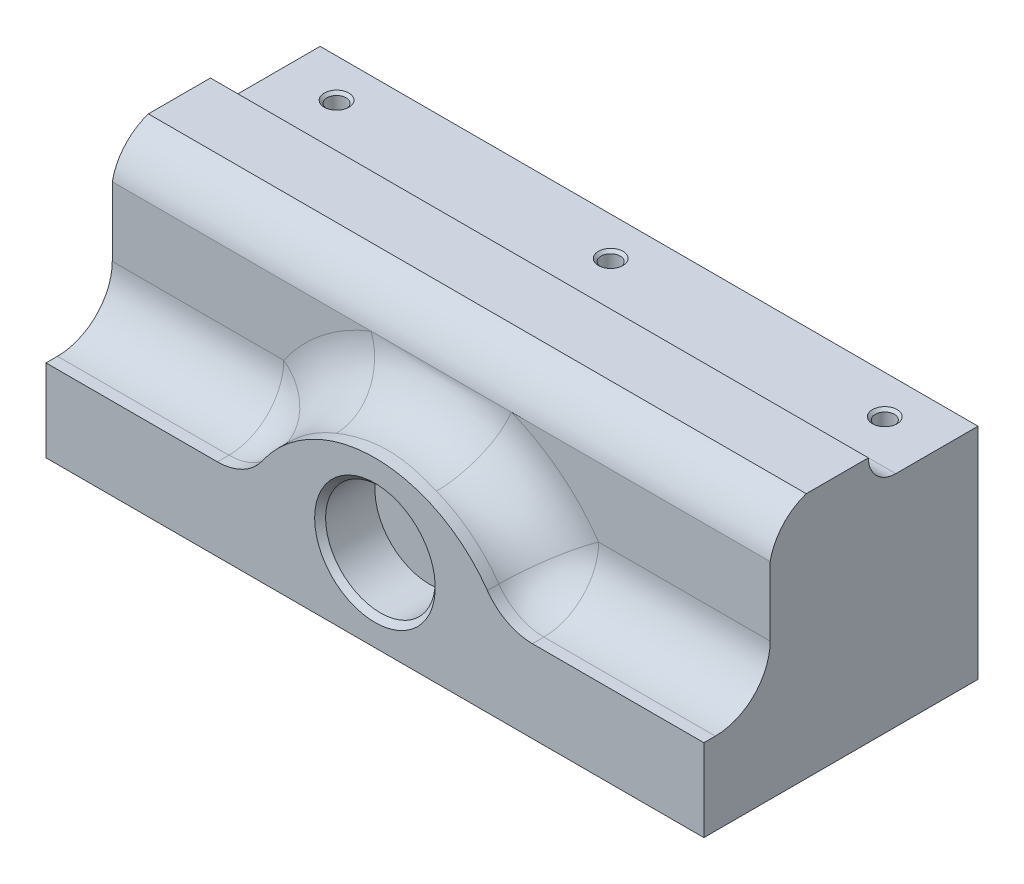
ISO-10303-21;
HEADER;
FILE_DESCRIPTION(('STEP AP214'),'2;1');
FILE_NAME('part.step','',(''),(''),'','','');
FILE_SCHEMA(('AUTOMOTIVE_DESIGN { 1 0 10303 214 1 1 1 1 }'));
ENDSEC;
DATA;
#1=APPLICATION_CONTEXT('core data for automotive mechanical design processes');
#2=APPLICATION_PROTOCOL_DEFINITION('international standard','automotive_design',2000,#1);
#3=PRODUCT_CONTEXT('',#1,'mechanical');
#4=PRODUCT('Part','Part','',(#3));
#5=PRODUCT_RELATED_PRODUCT_CATEGORY('part','',(#4));
#6=PRODUCT_DEFINITION_FORMATION('','',#4);
#7=PRODUCT_DEFINITION_CONTEXT('part definition',#1,'design');
#8=PRODUCT_DEFINITION('design','',#6,#7);
#9=PRODUCT_DEFINITION_SHAPE('','',#8);
#10=(LENGTH_UNIT() NAMED_UNIT(*) SI_UNIT(.MILLI.,.METRE.));
#11=(NAMED_UNIT(*) PLANE_ANGLE_UNIT() SI_UNIT($,.RADIAN.));
#12=(NAMED_UNIT(*) SI_UNIT($,.STERADIAN.) SOLID_ANGLE_UNIT());
#13=UNCERTAINTY_MEASURE_WITH_UNIT(LENGTH_MEASURE(1.E-05),#10,'distance_accuracy_value','');
#14=(GEOMETRIC_REPRESENTATION_CONTEXT(3) GLOBAL_UNCERTAINTY_ASSIGNED_CONTEXT((#13)) GLOBAL_UNIT_ASSIGNED_CONTEXT((#10,
#11,#12)) REPRESENTATION_CONTEXT('',''));
#15=CARTESIAN_POINT('',(0.,0.,0.));
#16=DIRECTION('',(0.,0.,1.));
#17=DIRECTION('',(1.,0.,0.));
#18=AXIS2_PLACEMENT_3D('',#15,#16,#17);
#19=CARTESIAN_POINT('',(-60.,0.,12.9117754314035));
#20=DIRECTION('',(0.,0.,-1.));
#21=DIRECTION('',(0.,1.,0.));
#22=AXIS2_PLACEMENT_3D('',#19,#20,#21);
#23=PLANE('',#22);
#24=DIRECTION('',(0.,1.,0.));
#25=VECTOR('',#24,1.);
#26=CARTESIAN_POINT('',(-60.,0.,12.9117754314035));
#27=LINE('',#26,#25);
#28=CARTESIAN_POINT('',(-60.,25.,12.9117754314035));
#29=VERTEX_POINT('',#28);
#30=CARTESIAN_POINT('',(-60.,37.576763824917,12.9117754314035));
#31=VERTEX_POINT('',#30);
#32=EDGE_CURVE('E212',#29,#31,#27,.T.);
#33=ORIENTED_EDGE('',*,*,#32,.F.);
#34=DIRECTION('',(1.,0.,0.));
#35=VECTOR('',#34,1.);
#36=CARTESIAN_POINT('',(-33.5410196624969,25.,12.9117754314035));
#37=LINE('',#36,#35);
#38=CARTESIAN_POINT('',(-28.7228132326901,25.,12.9117754314035));
#39=VERTEX_POINT('',#38);
#40=EDGE_CURVE('E401',#29,#39,#37,.T.);
#41=ORIENTED_EDGE('',*,*,#40,.T.);
#42=CARTESIAN_POINT('',(0.,5.,12.9117754314035));
#43=DIRECTION('',(0.,0.,-1.));
#44=DIRECTION('',(0.,1.,0.));
#45=AXIS2_PLACEMENT_3D('',#42,#43,#44);
#46=CIRCLE('',#45,35.);
#47=CARTESIAN_POINT('',(-12.7966581065362,37.576763824917,12.9117754314035));
#48=VERTEX_POINT('',#47);
#49=EDGE_CURVE('E392',#39,#48,#46,.T.);
#50=ORIENTED_EDGE('',*,*,#49,.T.);
#51=DIRECTION('',(1.,0.,0.));
#52=VECTOR('',#51,1.);
#53=CARTESIAN_POINT('',(-60.,37.576763824917,12.9117754314035));
#54=LINE('',#53,#52);
#55=EDGE_CURVE('E226',#31,#48,#54,.T.);
#56=ORIENTED_EDGE('',*,*,#55,.F.);
#57=EDGE_LOOP('',(#33,#41,#50,#56));
#58=FACE_BOUND('',#57,.T.);
#59=ADVANCED_FACE('F48',(#58),#23,.F.);
#60=CARTESIAN_POINT('',(-60.,15.,0.));
#61=DIRECTION('',(0.,-1.,0.));
#62=DIRECTION('',(0.,0.,-1.));
#63=AXIS2_PLACEMENT_3D('',#60,#61,#62);
#64=PLANE('',#63);
#65=DIRECTION('',(1.,0.,0.));
#66=VECTOR('',#65,1.);
#67=CARTESIAN_POINT('',(33.5410196624969,15.,22.9117754314035));
#68=LINE('',#67,#66);
#69=CARTESIAN_POINT('',(60.,15.,22.9117754314035));
#70=VERTEX_POINT('',#69);
#71=CARTESIAN_POINT('',(28.7228132326901,15.,22.9117754314035));
#72=VERTEX_POINT('',#71);
#73=EDGE_CURVE('E495',#70,#72,#68,.F.);
#74=ORIENTED_EDGE('',*,*,#73,.T.);
#75=DIRECTION('',(0.,0.,1.));
#76=VECTOR('',#75,1.);
#77=CARTESIAN_POINT('',(28.7228132326901,15.,0.));
#78=LINE('',#77,#76);
#79=CARTESIAN_POINT('',(28.7228132326901,15.,25.));
#80=VERTEX_POINT('',#79);
#81=EDGE_CURVE('E496',#72,#80,#78,.T.);
#82=ORIENTED_EDGE('',*,*,#81,.T.);
#83=DIRECTION('',(1.,0.,0.));
#84=VECTOR('',#83,1.);
#85=CARTESIAN_POINT('',(-60.,15.,25.));
#86=LINE('',#85,#84);
#87=CARTESIAN_POINT('',(60.,15.,25.));
#88=VERTEX_POINT('',#87);
#89=EDGE_CURVE('E222',#80,#88,#86,.T.);
#90=ORIENTED_EDGE('',*,*,#89,.T.);
#91=DIRECTION('',(0.,0.,-1.));
#92=VECTOR('',#91,1.);
#93=CARTESIAN_POINT('',(60.,15.,0.));
#94=LINE('',#93,#92);
#95=EDGE_CURVE('E209',#88,#70,#94,.T.);
#96=ORIENTED_EDGE('',*,*,#95,.T.);
#97=EDGE_LOOP('',(#74,#82,#90,#96));
#98=FACE_BOUND('',#97,.T.);
#99=ADVANCED_FACE('F362',(#98),#64,.F.);
#100=CARTESIAN_POINT('',(60.,45.,25.));
#101=DIRECTION('',(-1.,0.,0.));
#102=DIRECTION('',(0.,0.,1.));
#103=AXIS2_PLACEMENT_3D('',#100,#101,#102);
#104=PLANE('',#103);
#105=CARTESIAN_POINT('',(60.,45.,-10.));
#106=DIRECTION('',(1.,0.,0.));
#107=DIRECTION('',(0.,0.,-1.));
#108=AXIS2_PLACEMENT_3D('',#105,#106,#107);
#109=CIRCLE('',#108,4.99999999999999);
#110=CARTESIAN_POINT('',(60.,40.,-10.));
#111=VERTEX_POINT('',#110);
#112=CARTESIAN_POINT('',(60.,45.,-5.00000000000002));
#113=VERTEX_POINT('',#112);
#114=EDGE_CURVE('E182',#111,#113,#109,.F.);
#115=ORIENTED_EDGE('',*,*,#114,.T.);
#116=DIRECTION('',(0.,0.,-1.));
#117=VECTOR('',#116,1.);
#118=CARTESIAN_POINT('',(60.,45.,25.));
#119=LINE('',#118,#117);
#120=CARTESIAN_POINT('',(60.,45.,6.33098781599606));
#121=VERTEX_POINT('',#120);
#122=EDGE_CURVE('E230',#121,#113,#119,.T.);
#123=ORIENTED_EDGE('',*,*,#122,.F.);
#124=CARTESIAN_POINT('',(60.,35.5651602711268,3.16549390799802));
#125=DIRECTION('',(1.,0.,0.));
#126=DIRECTION('',(0.,0.,-1.));
#127=AXIS2_PLACEMENT_3D('',#124,#125,#126);
#128=CIRCLE('',#127,9.95171102831548);
#129=CARTESIAN_POINT('',(60.,37.576763824917,12.9117754314035));
#130=VERTEX_POINT('',#129);
#131=EDGE_CURVE('E206',#130,#121,#128,.F.);
#132=ORIENTED_EDGE('',*,*,#131,.F.);
#133=DIRECTION('',(0.,1.,0.));
#134=VECTOR('',#133,1.);
#135=CARTESIAN_POINT('',(60.,0.,12.9117754314035));
#136=LINE('',#135,#134);
#137=CARTESIAN_POINT('',(60.,25.,12.9117754314035));
#138=VERTEX_POINT('',#137);
#139=EDGE_CURVE('E204',#138,#130,#136,.T.);
#140=ORIENTED_EDGE('',*,*,#139,.F.);
#141=CARTESIAN_POINT('',(60.,25.,22.9117754314035));
#142=DIRECTION('',(-1.,0.,0.));
#143=DIRECTION('',(0.,0.,1.));
#144=AXIS2_PLACEMENT_3D('',#141,#142,#143);
#145=CIRCLE('',#144,10.);
#146=EDGE_CURVE('E399',#138,#70,#145,.T.);
#147=ORIENTED_EDGE('',*,*,#146,.T.);
#148=ORIENTED_EDGE('',*,*,#95,.F.);
#149=DIRECTION('',(0.,-1.,0.));
#150=VECTOR('',#149,1.);
#151=CARTESIAN_POINT('',(60.,45.,25.));
#152=LINE('',#151,#150);
#153=CARTESIAN_POINT('',(60.,0.,25.));
#154=VERTEX_POINT('',#153);
#155=EDGE_CURVE('E236',#88,#154,#152,.T.);
#156=ORIENTED_EDGE('',*,*,#155,.T.);
#157=DIRECTION('',(0.,0.,-1.));
#158=VECTOR('',#157,1.);
#159=CARTESIAN_POINT('',(60.,0.,25.));
#160=LINE('',#159,#158);
#161=CARTESIAN_POINT('',(60.,0.,-25.));
#162=VERTEX_POINT('',#161);
#163=EDGE_CURVE('E202',#154,#162,#160,.T.);
#164=ORIENTED_EDGE('',*,*,#163,.T.);
#165=DIRECTION('',(0.,-1.,0.));
#166=VECTOR('',#165,1.);
#167=CARTESIAN_POINT('',(60.,45.,-25.));
#168=LINE('',#167,#166);
#169=CARTESIAN_POINT('',(60.,40.,-25.));
#170=VERTEX_POINT('',#169);
#171=EDGE_CURVE('E194',#170,#162,#168,.T.);
#172=ORIENTED_EDGE('',*,*,#171,.F.);
#173=DIRECTION('',(0.,0.,1.));
#174=VECTOR('',#173,1.);
#175=CARTESIAN_POINT('',(60.,40.,0.));
#176=LINE('',#175,#174);
#177=EDGE_CURVE('E173',#170,#111,#176,.T.);
#178=ORIENTED_EDGE('',*,*,#177,.T.);
#179=EDGE_LOOP('',(#115,#123,#132,#140,#147,#148,#156,#164,#172,#178));
#180=FACE_BOUND('',#179,.T.);
#181=ADVANCED_FACE('F192',(#180),#104,.F.);
#182=CARTESIAN_POINT('',(-60.,45.,-25.));
#183=DIRECTION('',(0.,0.,1.));
#184=DIRECTION('',(1.,0.,0.));
#185=AXIS2_PLACEMENT_3D('',#182,#183,#184);
#186=PLANE('',#185);
#187=DIRECTION('',(1.,0.,0.));
#188=VECTOR('',#187,1.);
#189=CARTESIAN_POINT('',(-60.,40.,-25.));
#190=LINE('',#189,#188);
#191=CARTESIAN_POINT('',(-60.,40.,-25.));
#192=VERTEX_POINT('',#191);
#193=EDGE_CURVE('E179',#192,#170,#190,.T.);
#194=ORIENTED_EDGE('',*,*,#193,.T.);
#195=ORIENTED_EDGE('',*,*,#171,.T.);
#196=DIRECTION('',(-1.,0.,0.));
#197=VECTOR('',#196,1.);
#198=CARTESIAN_POINT('',(-60.,0.,-25.));
#199=LINE('',#198,#197);
#200=CARTESIAN_POINT('',(-60.,0.,-25.));
#201=VERTEX_POINT('',#200);
#202=EDGE_CURVE('E238',#162,#201,#199,.T.);
#203=ORIENTED_EDGE('',*,*,#202,.T.);
#204=DIRECTION('',(0.,-1.,0.));
#205=VECTOR('',#204,1.);
#206=CARTESIAN_POINT('',(-60.,45.,-25.));
#207=LINE('',#206,#205);
#208=EDGE_CURVE('E249',#192,#201,#207,.T.);
#209=ORIENTED_EDGE('',*,*,#208,.F.);
#210=EDGE_LOOP('',(#194,#195,#203,#209));
#211=FACE_BOUND('',#210,.T.);
#212=ADVANCED_FACE('F513',(#211),#186,.F.);
#213=CARTESIAN_POINT('',(-60.,45.,25.));
#214=DIRECTION('',(1.,0.,0.));
#215=DIRECTION('',(0.,0.,-1.));
#216=AXIS2_PLACEMENT_3D('',#213,#214,#215);
#217=PLANE('',#216);
#218=CARTESIAN_POINT('',(-60.,45.,-10.));
#219=DIRECTION('',(1.,0.,0.));
#220=DIRECTION('',(0.,0.,-1.));
#221=AXIS2_PLACEMENT_3D('',#218,#219,#220);
#222=CIRCLE('',#221,4.99999999999999);
#223=CARTESIAN_POINT('',(-60.,40.,-10.));
#224=VERTEX_POINT('',#223);
#225=CARTESIAN_POINT('',(-60.,45.,-5.00000000000001));
#226=VERTEX_POINT('',#225);
#227=EDGE_CURVE('E195',#224,#226,#222,.F.);
#228=ORIENTED_EDGE('',*,*,#227,.F.);
#229=DIRECTION('',(0.,0.,1.));
#230=VECTOR('',#229,1.);
#231=CARTESIAN_POINT('',(-60.,40.,0.));
#232=LINE('',#231,#230);
#233=EDGE_CURVE('E176',#192,#224,#232,.T.);
#234=ORIENTED_EDGE('',*,*,#233,.F.);
#235=ORIENTED_EDGE('',*,*,#208,.T.);
#236=DIRECTION('',(0.,0.,1.));
#237=VECTOR('',#236,1.);
#238=CARTESIAN_POINT('',(-60.,0.,25.));
#239=LINE('',#238,#237);
#240=CARTESIAN_POINT('',(-60.,0.,25.));
#241=VERTEX_POINT('',#240);
#242=EDGE_CURVE('E241',#201,#241,#239,.T.);
#243=ORIENTED_EDGE('',*,*,#242,.T.);
#244=DIRECTION('',(0.,-1.,0.));
#245=VECTOR('',#244,1.);
#246=CARTESIAN_POINT('',(-60.,45.,25.));
#247=LINE('',#246,#245);
#248=CARTESIAN_POINT('',(-60.,15.,25.));
#249=VERTEX_POINT('',#248);
#250=EDGE_CURVE('E247',#249,#241,#247,.T.);
#251=ORIENTED_EDGE('',*,*,#250,.F.);
#252=DIRECTION('',(0.,0.,-1.));
#253=VECTOR('',#252,1.);
#254=CARTESIAN_POINT('',(-60.,15.,0.));
#255=LINE('',#254,#253);
#256=CARTESIAN_POINT('',(-60.,15.,22.9117754314035));
#257=VERTEX_POINT('',#256);
#258=EDGE_CURVE('E217',#249,#257,#255,.T.);
#259=ORIENTED_EDGE('',*,*,#258,.T.);
#260=CARTESIAN_POINT('',(-60.,25.,22.9117754314035));
#261=DIRECTION('',(1.,0.,0.));
#262=DIRECTION('',(0.,0.,-1.));
#263=AXIS2_PLACEMENT_3D('',#260,#261,#262);
#264=CIRCLE('',#263,10.);
#265=EDGE_CURVE('E72',#257,#29,#264,.T.);
#266=ORIENTED_EDGE('',*,*,#265,.T.);
#267=ORIENTED_EDGE('',*,*,#32,.T.);
#268=CARTESIAN_POINT('',(-60.,35.5651602711268,3.16549390799802));
#269=DIRECTION('',(1.,0.,0.));
#270=DIRECTION('',(0.,0.,-1.));
#271=AXIS2_PLACEMENT_3D('',#268,#269,#270);
#272=CIRCLE('',#271,9.95171102831548);
#273=CARTESIAN_POINT('',(-60.,45.,6.33098781599606));
#274=VERTEX_POINT('',#273);
#275=EDGE_CURVE('E214',#31,#274,#272,.F.);
#276=ORIENTED_EDGE('',*,*,#275,.T.);
#277=DIRECTION('',(0.,0.,1.));
#278=VECTOR('',#277,1.);
#279=CARTESIAN_POINT('',(-60.,45.,25.));
#280=LINE('',#279,#278);
#281=EDGE_CURVE('E232',#226,#274,#280,.T.);
#282=ORIENTED_EDGE('',*,*,#281,.F.);
#283=EDGE_LOOP('',(#228,#234,#235,#243,#251,#259,#266,#267,#276,#282));
#284=FACE_BOUND('',#283,.T.);
#285=ADVANCED_FACE('F506',(#284),#217,.F.);
#286=CARTESIAN_POINT('',(0.,45.,0.));
#287=DIRECTION('',(0.,-1.,0.));
#288=DIRECTION('',(0.,0.,-1.));
#289=AXIS2_PLACEMENT_3D('',#286,#287,#288);
#290=PLANE('',#289);
#291=DIRECTION('',(1.,0.,0.));
#292=VECTOR('',#291,1.);
#293=CARTESIAN_POINT('',(-60.,45.,-5.00000000000002));
#294=LINE('',#293,#292);
#295=EDGE_CURVE('E185',#226,#113,#294,.T.);
#296=ORIENTED_EDGE('',*,*,#295,.F.);
#297=ORIENTED_EDGE('',*,*,#281,.T.);
#298=DIRECTION('',(1.,0.,0.));
#299=VECTOR('',#298,1.);
#300=CARTESIAN_POINT('',(-60.,45.,6.33098781599606));
#301=LINE('',#300,#299);
#302=EDGE_CURVE('E223',#274,#121,#301,.T.);
#303=ORIENTED_EDGE('',*,*,#302,.T.);
#304=ORIENTED_EDGE('',*,*,#122,.T.);
#305=EDGE_LOOP('',(#296,#297,#303,#304));
#306=FACE_BOUND('',#305,.T.);
#307=ADVANCED_FACE('F516',(#306),#290,.F.);
#308=CARTESIAN_POINT('',(-60.,45.,25.));
#309=DIRECTION('',(0.,0.,-1.));
#310=DIRECTION('',(-1.,0.,0.));
#311=AXIS2_PLACEMENT_3D('',#308,#309,#310);
#312=PLANE('',#311);
#313=CARTESIAN_POINT('',(0.,15.,25.));
#314=DIRECTION('',(0.,0.,-1.));
#315=DIRECTION('',(-1.,0.,0.));
#316=AXIS2_PLACEMENT_3D('',#313,#314,#315);
#317=CIRCLE('',#316,11.);
#318=CARTESIAN_POINT('',(-11.,15.,25.));
#319=VERTEX_POINT('',#318);
#320=EDGE_CURVE('E420',#319,#319,#317,.T.);
#321=ORIENTED_EDGE('',*,*,#320,.T.);
#322=EDGE_LOOP('',(#321));
#323=FACE_BOUND('',#322,.T.);
#324=ORIENTED_EDGE('',*,*,#155,.F.);
#325=ORIENTED_EDGE('',*,*,#89,.F.);
#326=CARTESIAN_POINT('',(28.7228132326901,25.,25.));
#327=DIRECTION('',(0.,0.,-1.));
#328=DIRECTION('',(-1.,0.,0.));
#329=AXIS2_PLACEMENT_3D('',#326,#327,#328);
#330=CIRCLE('',#329,10.);
#331=CARTESIAN_POINT('',(20.5162951662072,19.2857142857143,25.));
#332=VERTEX_POINT('',#331);
#333=EDGE_CURVE('E464',#80,#332,#330,.T.);
#334=ORIENTED_EDGE('',*,*,#333,.T.);
#335=CARTESIAN_POINT('',(0.,5.,25.));
#336=DIRECTION('',(0.,0.,1.));
#337=DIRECTION('',(1.,0.,0.));
#338=AXIS2_PLACEMENT_3D('',#335,#336,#337);
#339=CIRCLE('',#338,25.);
#340=CARTESIAN_POINT('',(-20.5162951662072,19.2857142857143,25.));
#341=VERTEX_POINT('',#340);
#342=EDGE_CURVE('E207',#332,#341,#339,.T.);
#343=ORIENTED_EDGE('',*,*,#342,.T.);
#344=CARTESIAN_POINT('',(-28.7228132326901,25.,25.));
#345=DIRECTION('',(0.,0.,-1.));
#346=DIRECTION('',(-1.,0.,0.));
#347=AXIS2_PLACEMENT_3D('',#344,#345,#346);
#348=CIRCLE('',#347,10.);
#349=CARTESIAN_POINT('',(-28.7228132326901,15.,25.));
#350=VERTEX_POINT('',#349);
#351=EDGE_CURVE('E400',#341,#350,#348,.T.);
#352=ORIENTED_EDGE('',*,*,#351,.T.);
#353=EDGE_CURVE('E189',#249,#350,#86,.T.);
#354=ORIENTED_EDGE('',*,*,#353,.F.);
#355=ORIENTED_EDGE('',*,*,#250,.T.);
#356=DIRECTION('',(1.,0.,0.));
#357=VECTOR('',#356,1.);
#358=CARTESIAN_POINT('',(-60.,0.,25.));
#359=LINE('',#358,#357);
#360=EDGE_CURVE('E233',#241,#154,#359,.T.);
#361=ORIENTED_EDGE('',*,*,#360,.T.);
#362=EDGE_LOOP('',(#324,#325,#334,#343,#352,#354,#355,#361));
#363=FACE_BOUND('',#362,.T.);
#364=ADVANCED_FACE('F382',(#323,#363),#312,.F.);
#365=CARTESIAN_POINT('',(0.,0.,0.));
#366=DIRECTION('',(0.,-1.,0.));
#367=DIRECTION('',(0.,0.,-1.));
#368=AXIS2_PLACEMENT_3D('',#365,#366,#367);
#369=PLANE('',#368);
#370=ORIENTED_EDGE('',*,*,#163,.F.);
#371=ORIENTED_EDGE('',*,*,#360,.F.);
#372=ORIENTED_EDGE('',*,*,#242,.F.);
#373=ORIENTED_EDGE('',*,*,#202,.F.);
#374=EDGE_LOOP('',(#370,#371,#372,#373));
#375=FACE_BOUND('',#374,.T.);
#376=ADVANCED_FACE('F374',(#375),#369,.T.);
#377=CARTESIAN_POINT('',(0.,5.,12.9117754314035));
#378=DIRECTION('',(0.,0.,-1.));
#379=DIRECTION('',(0.,1.,0.));
#380=AXIS2_PLACEMENT_3D('',#377,#378,#379);
#381=CIRCLE('',#380,35.);
#382=CARTESIAN_POINT('',(12.7966581065362,37.576763824917,12.9117754314035));
#383=VERTEX_POINT('',#382);
#384=CARTESIAN_POINT('',(28.7228132326901,25.,12.9117754314035));
#385=VERTEX_POINT('',#384);
#386=EDGE_CURVE('E386',#383,#385,#381,.T.);
#387=ORIENTED_EDGE('',*,*,#386,.T.);
#388=DIRECTION('',(1.,0.,0.));
#389=VECTOR('',#388,1.);
#390=CARTESIAN_POINT('',(60.,25.,12.9117754314035));
#391=LINE('',#390,#389);
#392=EDGE_CURVE('E64',#385,#138,#391,.T.);
#393=ORIENTED_EDGE('',*,*,#392,.T.);
#394=ORIENTED_EDGE('',*,*,#139,.T.);
#395=EDGE_CURVE('E219',#383,#130,#54,.T.);
#396=ORIENTED_EDGE('',*,*,#395,.F.);
#397=EDGE_LOOP('',(#387,#393,#394,#396));
#398=FACE_BOUND('',#397,.T.);
#399=ADVANCED_FACE('F364',(#398),#23,.F.);
#400=ORIENTED_EDGE('',*,*,#353,.T.);
#401=DIRECTION('',(0.,0.,1.));
#402=VECTOR('',#401,1.);
#403=CARTESIAN_POINT('',(-28.7228132326901,15.,0.));
#404=LINE('',#403,#402);
#405=CARTESIAN_POINT('',(-28.7228132326901,15.,22.9117754314035));
#406=VERTEX_POINT('',#405);
#407=EDGE_CURVE('E487',#350,#406,#404,.F.);
#408=ORIENTED_EDGE('',*,*,#407,.T.);
#409=DIRECTION('',(1.,0.,0.));
#410=VECTOR('',#409,1.);
#411=CARTESIAN_POINT('',(-60.,15.,22.9117754314035));
#412=LINE('',#411,#410);
#413=EDGE_CURVE('E470',#406,#257,#412,.F.);
#414=ORIENTED_EDGE('',*,*,#413,.T.);
#415=ORIENTED_EDGE('',*,*,#258,.F.);
#416=EDGE_LOOP('',(#400,#408,#414,#415));
#417=FACE_BOUND('',#416,.T.);
#418=ADVANCED_FACE('F370',(#417),#64,.F.);
#419=CARTESIAN_POINT('',(-60.,35.5651602711268,3.16549390799802));
#420=DIRECTION('',(1.,0.,0.));
#421=DIRECTION('',(0.,0.,-1.));
#422=AXIS2_PLACEMENT_3D('',#419,#420,#421);
#423=CYLINDRICAL_SURFACE('',#422,9.95171102831548);
#424=ORIENTED_EDGE('',*,*,#302,.F.);
#425=ORIENTED_EDGE('',*,*,#275,.F.);
#426=ORIENTED_EDGE('',*,*,#55,.T.);
#427=EDGE_CURVE('E229',#48,#383,#54,.T.);
#428=ORIENTED_EDGE('',*,*,#427,.T.);
#429=ORIENTED_EDGE('',*,*,#395,.T.);
#430=ORIENTED_EDGE('',*,*,#131,.T.);
#431=EDGE_LOOP('',(#424,#425,#426,#428,#429,#430));
#432=FACE_BOUND('',#431,.T.);
#433=ADVANCED_FACE('F379',(#432),#423,.T.);
#434=CARTESIAN_POINT('',(-60.,45.,-10.));
#435=DIRECTION('',(1.,0.,0.));
#436=DIRECTION('',(0.,0.,-1.));
#437=AXIS2_PLACEMENT_3D('',#434,#435,#436);
#438=CYLINDRICAL_SURFACE('',#437,4.99999999999999);
#439=DIRECTION('',(1.,0.,0.));
#440=VECTOR('',#439,1.);
#441=CARTESIAN_POINT('',(-60.,40.,-10.));
#442=LINE('',#441,#440);
#443=EDGE_CURVE('E169',#224,#111,#442,.T.);
#444=ORIENTED_EDGE('',*,*,#443,.F.);
#445=ORIENTED_EDGE('',*,*,#227,.T.);
#446=ORIENTED_EDGE('',*,*,#295,.T.);
#447=ORIENTED_EDGE('',*,*,#114,.F.);
#448=EDGE_LOOP('',(#444,#445,#446,#447));
#449=FACE_BOUND('',#448,.T.);
#450=ADVANCED_FACE('F183',(#449),#438,.F.);
#451=CARTESIAN_POINT('',(-60.,40.,0.));
#452=DIRECTION('',(0.,1.,0.));
#453=DIRECTION('',(0.,0.,1.));
#454=AXIS2_PLACEMENT_3D('',#451,#452,#453);
#455=PLANE('',#454);
#456=CARTESIAN_POINT('',(-50.,40.,-18.));
#457=DIRECTION('',(0.,1.,0.));
#458=DIRECTION('',(0.,0.,1.));
#459=AXIS2_PLACEMENT_3D('',#456,#457,#458);
#460=CIRCLE('',#459,2.25000000000002);
#461=CARTESIAN_POINT('',(-50.,40.,-15.75));
#462=VERTEX_POINT('',#461);
#463=EDGE_CURVE('E432',#462,#462,#460,.F.);
#464=ORIENTED_EDGE('',*,*,#463,.T.);
#465=EDGE_LOOP('',(#464));
#466=FACE_BOUND('',#465,.T.);
#467=CARTESIAN_POINT('',(0.,40.,-18.));
#468=DIRECTION('',(0.,1.,0.));
#469=DIRECTION('',(0.,0.,1.));
#470=AXIS2_PLACEMENT_3D('',#467,#468,#469);
#471=CIRCLE('',#470,2.25000000000001);
#472=CARTESIAN_POINT('',(0.,40.,-15.75));
#473=VERTEX_POINT('',#472);
#474=EDGE_CURVE('E429',#473,#473,#471,.F.);
#475=ORIENTED_EDGE('',*,*,#474,.T.);
#476=EDGE_LOOP('',(#475));
#477=FACE_BOUND('',#476,.T.);
#478=CARTESIAN_POINT('',(50.,40.,-18.));
#479=DIRECTION('',(0.,1.,0.));
#480=DIRECTION('',(0.,0.,1.));
#481=AXIS2_PLACEMENT_3D('',#478,#479,#480);
#482=CIRCLE('',#481,2.25000000000002);
#483=CARTESIAN_POINT('',(50.,40.,-15.75));
#484=VERTEX_POINT('',#483);
#485=EDGE_CURVE('E426',#484,#484,#482,.F.);
#486=ORIENTED_EDGE('',*,*,#485,.T.);
#487=EDGE_LOOP('',(#486));
#488=FACE_BOUND('',#487,.T.);
#489=ORIENTED_EDGE('',*,*,#193,.F.);
#490=ORIENTED_EDGE('',*,*,#233,.T.);
#491=ORIENTED_EDGE('',*,*,#443,.T.);
#492=ORIENTED_EDGE('',*,*,#177,.F.);
#493=EDGE_LOOP('',(#489,#490,#491,#492));
#494=FACE_BOUND('',#493,.T.);
#495=ADVANCED_FACE('F171',(#466,#477,#488,#494),#455,.T.);
#496=CARTESIAN_POINT('',(0.,5.,-25.002));
#497=DIRECTION('',(0.,0.,1.));
#498=DIRECTION('',(1.,0.,0.));
#499=AXIS2_PLACEMENT_3D('',#496,#497,#498);
#500=CYLINDRICAL_SURFACE('',#499,25.);
#501=CARTESIAN_POINT('',(0.,5.,22.9117754314035));
#502=DIRECTION('',(0.,0.,-1.));
#503=DIRECTION('',(0.,1.,0.));
#504=AXIS2_PLACEMENT_3D('',#501,#502,#503);
#505=CIRCLE('',#504,25.);
#506=CARTESIAN_POINT('',(-9.14047007609732,28.2691170177978,22.9117754314035));
#507=VERTEX_POINT('',#506);
#508=CARTESIAN_POINT('',(-20.5162951662072,19.2857142857143,22.9117754314035));
#509=VERTEX_POINT('',#508);
#510=EDGE_CURVE('E252',#507,#509,#505,.F.);
#511=ORIENTED_EDGE('',*,*,#510,.T.);
#512=DIRECTION('',(0.,0.,1.));
#513=VECTOR('',#512,1.);
#514=CARTESIAN_POINT('',(-20.5162951662072,19.2857142857143,-25.002));
#515=LINE('',#514,#513);
#516=EDGE_CURVE('E469',#509,#341,#515,.T.);
#517=ORIENTED_EDGE('',*,*,#516,.T.);
#518=ORIENTED_EDGE('',*,*,#342,.F.);
#519=DIRECTION('',(0.,0.,1.));
#520=VECTOR('',#519,1.);
#521=CARTESIAN_POINT('',(20.5162951662072,19.2857142857143,-25.002));
#522=LINE('',#521,#520);
#523=CARTESIAN_POINT('',(20.5162951662072,19.2857142857143,22.9117754314035));
#524=VERTEX_POINT('',#523);
#525=EDGE_CURVE('E301',#332,#524,#522,.F.);
#526=ORIENTED_EDGE('',*,*,#525,.T.);
#527=CARTESIAN_POINT('',(0.,5.,22.9117754314035));
#528=DIRECTION('',(0.,0.,-1.));
#529=DIRECTION('',(0.,1.,0.));
#530=AXIS2_PLACEMENT_3D('',#527,#528,#529);
#531=CIRCLE('',#530,25.);
#532=CARTESIAN_POINT('',(9.14047007609732,28.2691170177978,22.9117754314035));
#533=VERTEX_POINT('',#532);
#534=EDGE_CURVE('E263',#524,#533,#531,.F.);
#535=ORIENTED_EDGE('',*,*,#534,.T.);
#536=CARTESIAN_POINT('',(-15.6758454601784,37.576763824917,12.9117754314035));
#537=CARTESIAN_POINT('',(-10.6164259182426,27.6431710615215,11.626157433251));
#538=CARTESIAN_POINT('',(-11.197032471556,27.3523256917691,22.8290637494094));
#539=CARTESIAN_POINT('',(-15.2764192765052,37.576763824917,12.9117754314035));
#540=CARTESIAN_POINT('',(-10.4456834078619,27.7196668039992,11.8380408138911));
#541=CARTESIAN_POINT('',(-10.9117280546481,27.495254701332,22.8549104969969));
#542=CARTESIAN_POINT('',(-14.8728581340676,37.576763824917,12.9117754314035));
#543=CARTESIAN_POINT('',(-10.2556645789836,27.8041994528147,12.0382279177274));
#544=CARTESIAN_POINT('',(-10.6234700957634,27.6328094561105,22.873728386049));
#545=CARTESIAN_POINT('',(-14.0584540460236,37.576763824917,12.9117754314035));
#546=CARTESIAN_POINT('',(-9.84523727504454,27.9816599068082,12.411350238133));
#547=CARTESIAN_POINT('',(-10.0417528900154,27.8968353813852,22.8999148476686));
#548=CARTESIAN_POINT('',(-13.6476132271442,37.576763824917,12.9117754314035));
#549=CARTESIAN_POINT('',(-9.62510079354189,28.0745534533265,12.5850021965991));
#550=CARTESIAN_POINT('',(-9.74829516224296,28.0233097268252,22.9072867101335));
#551=CARTESIAN_POINT('',(-12.8197857673578,37.576763824917,12.9117754314035));
#552=CARTESIAN_POINT('',(-9.15928227666601,28.2629622270684,12.9065521262421));
#553=CARTESIAN_POINT('',(-9.15698983382444,28.2648118513757,22.9131986727052));
#554=CARTESIAN_POINT('',(-12.402805087496,37.576763824917,12.9117754314035));
#555=CARTESIAN_POINT('',(-8.91371545540341,28.3585578217316,13.0550850115058));
#556=CARTESIAN_POINT('',(-8.85914649106775,28.3798499878846,22.9117468395864));
#557=CARTESIAN_POINT('',(-11.56304670588,37.576763824917,12.9117754314035));
#558=CARTESIAN_POINT('',(-8.40096297870703,28.548197257876,13.3288118209506));
#559=CARTESIAN_POINT('',(-8.25931907562945,28.5984230396097,22.9023136901057));
#560=CARTESIAN_POINT('',(-11.1402685589397,37.576763824917,12.9117754314035));
#561=CARTESIAN_POINT('',(-8.13372330286028,28.64239317239,13.4545171675456));
#562=CARTESIAN_POINT('',(-7.95733468495769,28.7019570658078,22.8943318695155));
#563=CARTESIAN_POINT('',(-9.86557455373831,37.576763824917,12.9117754314035));
#564=CARTESIAN_POINT('',(-7.31071961142095,28.9154583772736,13.7973904963272));
#565=CARTESIAN_POINT('',(-7.04683896695438,28.9947492793533,22.8638271826547));
#566=CARTESIAN_POINT('',(-9.00585513640247,37.576763824917,12.9117754314035));
#567=CARTESIAN_POINT('',(-6.72164798905812,29.0896505832958,13.9875506763731));
#568=CARTESIAN_POINT('',(-6.43275366885296,29.1666186181485,22.8347402373973));
#569=CARTESIAN_POINT('',(-7.27057981305832,37.576763824917,12.9117754314035));
#570=CARTESIAN_POINT('',(-5.49527874798694,29.3985111547935,14.298988684596));
#571=CARTESIAN_POINT('',(-5.19327129503567,29.4629561655421,22.7733383272399));
#572=CARTESIAN_POINT('',(-6.39502000521542,37.576763824917,12.9117754314035));
#573=CARTESIAN_POINT('',(-4.85535899102082,29.5347633243954,14.4223823241359));
#574=CARTESIAN_POINT('',(-4.56787143229511,29.5874125240735,22.7410225578944));
#575=CARTESIAN_POINT('',(-4.59291433331134,37.576763824917,12.9117754314035));
#576=CARTESIAN_POINT('',(-3.51708381159699,29.7620464581915,14.6184532378403));
#577=CARTESIAN_POINT('',(-3.28065309522407,29.7927604587916,22.6827805770167));
#578=CARTESIAN_POINT('',(-3.66585497446431,37.576763824917,12.9117754314035));
#579=CARTESIAN_POINT('',(-2.81318578392117,29.8522088933387,14.6899970950761));
#580=CARTESIAN_POINT('',(-2.61846783890345,29.8714242272766,22.6572099450929));
#581=CARTESIAN_POINT('',(-1.80567684049207,37.576763824917,12.9117754314035));
#582=CARTESIAN_POINT('',(-1.39278373604806,29.9714455305481,14.7830526762427));
#583=CARTESIAN_POINT('',(-1.28976917177951,29.975598587257,22.6224905137945));
#584=CARTESIAN_POINT('',(-0.872558706121054,37.576763824917,12.9117754314035));
#585=CARTESIAN_POINT('',(-0.671826639064135,30.0012895302352,14.8051801909472));
#586=CARTESIAN_POINT('',(-0.623256218657779,30.0011147104878,22.6133400053872));
#587=CARTESIAN_POINT('',(0.993676474187566,37.576763824917,12.9117754314035));
#588=CARTESIAN_POINT('',(0.765188911059885,29.9986237612073,14.8031689014381));
#589=CARTESIAN_POINT('',(0.709768910133861,29.9988104450655,22.6141465767331));
#590=CARTESIAN_POINT('',(1.9267935010248,37.576763824917,12.9117754314035));
#591=CARTESIAN_POINT('',(1.48587566326644,29.9660878300091,14.779010577464));
#592=CARTESIAN_POINT('',(1.37628107216064,29.9709824560122,22.6241063792988));
#593=CARTESIAN_POINT('',(3.7867383276295,37.576763824917,12.9117754314035));
#594=CARTESIAN_POINT('',(2.90500581495751,29.8416835463134,14.6816258690059));
#595=CARTESIAN_POINT('',(2.70481309116377,29.8621859205708,22.6602018964035));
#596=CARTESIAN_POINT('',(4.71356509004655,37.576763824917,12.9117754314035));
#597=CARTESIAN_POINT('',(3.60788707994355,29.7490095921313,14.6077510287146));
#598=CARTESIAN_POINT('',(3.36683220717553,29.7812088144564,22.6863402164727));
#599=CARTESIAN_POINT('',(6.58529677210775,37.576763824917,12.9117754314035));
#600=CARTESIAN_POINT('',(4.9961790895986,29.5080059695965,14.3986557167835));
#601=CARTESIAN_POINT('',(4.703783408649,29.5631490600351,22.7475735626219));
#602=CARTESIAN_POINT('',(7.5297887895023,37.576763824917,12.9117754314035));
#603=CARTESIAN_POINT('',(5.68414188576848,29.356412936057,14.2599763977629));
#604=CARTESIAN_POINT('',(5.3784205639325,29.4243029160926,22.7829357234079));
#605=CARTESIAN_POINT('',(9.3995968833767,37.576763824917,12.9117754314035));
#606=CARTESIAN_POINT('',(6.99461383986767,29.0129723777872,13.9052887874966));
#607=CARTESIAN_POINT('',(6.71399777383821,29.0913998913122,22.8480796364462));
#608=CARTESIAN_POINT('',(10.3249183842007,37.576763824917,12.9117754314035));
#609=CARTESIAN_POINT('',(7.6202632883399,28.8191007007566,13.6864419214705));
#610=CARTESIAN_POINT('',(7.374941702992,28.8973588633748,22.8778629869589));
#611=CARTESIAN_POINT('',(11.6948370179007,37.576763824917,12.9117754314035));
#612=CARTESIAN_POINT('',(8.48355033204665,28.5190103185411,13.2885360766589));
#613=CARTESIAN_POINT('',(8.35345501279046,28.565629027343,22.9043508078397));
#614=CARTESIAN_POINT('',(12.1489901048172,37.576763824917,12.9117754314035));
#615=CARTESIAN_POINT('',(8.76234641577392,28.415917783091,13.1418389089653));
#616=CARTESIAN_POINT('',(8.67785007488167,28.4481119127362,22.9101449443012));
#617=CARTESIAN_POINT('',(13.0501098637879,37.576763824917,12.9117754314035));
#618=CARTESIAN_POINT('',(9.29246992784137,28.210539492988,12.8212937907078));
#619=CARTESIAN_POINT('',(9.32150704555053,28.1997513101261,22.9128170004001));
#620=CARTESIAN_POINT('',(13.4970773730459,37.576763824917,12.9117754314035));
#621=CARTESIAN_POINT('',(9.54378491685145,28.1080983197532,12.6467403980838));
#622=CARTESIAN_POINT('',(9.64076955213093,28.0689093878403,22.9096959664423));
#623=CARTESIAN_POINT('',(14.3834572895986,37.576763824917,12.9117754314035));
#624=CARTESIAN_POINT('',(10.0140885405988,27.9097876573202,12.2678386051052));
#625=CARTESIAN_POINT('',(10.2738980639492,27.79399516224,22.8914949900399));
#626=CARTESIAN_POINT('',(14.8228589378191,37.576763824917,12.9117754314035));
#627=CARTESIAN_POINT('',(10.2327968371913,27.813895929159,12.0626051087909));
#628=CARTESIAN_POINT('',(10.5877563841343,27.6499056116751,22.8763992569544));
#629=CARTESIAN_POINT('',(15.692465862253,37.576763824917,12.9117754314035));
#630=CARTESIAN_POINT('',(10.6316430047214,27.6367683945457,11.6212550028672));
#631=CARTESIAN_POINT('',(11.208904187342,27.3490453555687,22.8307124199388));
#632=CARTESIAN_POINT('',(16.1226669895448,37.576763824917,12.9117754314035));
#633=CARTESIAN_POINT('',(10.8112613500327,27.5557109811444,11.3841568109658));
#634=CARTESIAN_POINT('',(11.5161907068492,27.1922690753569,22.8001144727792));
#635=CARTESIAN_POINT('',(16.5475555333463,37.576763824917,12.9117754314035));
#636=CARTESIAN_POINT('',(10.9660758558351,27.4874094552672,11.1336989471968));
#637=CARTESIAN_POINT('',(11.8196825238188,27.0294145413838,22.7600113155173));
#638=(BOUNDED_SURFACE() B_SPLINE_SURFACE(3,2,((#536,#537,#538),(#539,#540,#541),(#542,#543,
#544),(#545,#546,#547),(#548,#549,#550),(#551,#552,#553),(#554,#555,#556),(#557,#558,#559),
(#560,#561,#562),(#563,#564,#565),(#566,#567,#568),(#569,#570,#571),(#572,#573,#574),(#575,#576,
#577),(#578,#579,#580),(#581,#582,#583),(#584,#585,#586),(#587,#588,#589),(#590,#591,#592),
(#593,#594,#595),(#596,#597,#598),(#599,#600,#601),(#602,#603,#604),(#605,#606,#607),(#608,#609,
#610),(#611,#612,#613),(#614,#615,#616),(#617,#618,#619),(#620,#621,#622),(#623,#624,#625),
(#626,#627,#628),(#629,#630,#631),(#632,#633,#634),(#635,#636,#637)),.UNSPECIFIED.,.F.,.F.,
.F.) B_SPLINE_SURFACE_WITH_KNOTS((4,2,2,2,2,2,2,2,2,2,2,2,2,2,2,2,4),(3,3),(0.,1.34222495798292,
2.68406405275938,4.02467659978119,5.36539267512685,8.04215920508311,10.7195943090097,
13.5182648547439,16.3166440935182,19.1154220713812,21.9146509062823,24.8062651460356,
27.6970497026166,29.1458583932915,30.5944970392058,32.0450491390642,33.4962421229299),(0.,1.),
.UNSPECIFIED.) GEOMETRIC_REPRESENTATION_ITEM() RATIONAL_B_SPLINE_SURFACE(((1.,0.66529784963564,
1.),(1.,0.671745568954602,1.),(1.,0.677984943835129,1.),(1.,0.690014331670612,1.),(1.,
0.695804473292607,1.),(1.,0.706901390232983,1.),(1.,0.712208602548743,1.),(1.,0.722323502820255,
1.),(1.,0.727131152168768,1.),(1.,0.740761434091913,1.),(1.,0.748810831123771,1.),(1.,
0.762732364286173,1.),(1.,0.768603956101736,1.),(1.,0.778308843508639,1.),(1.,0.782037805516119,
1.),(1.,0.786978814921904,1.),(1.,0.788191124259461,1.),(1.,0.788081704709254,1.),(1.,
0.786759614723551,1.),(1.,0.781599926269213,1.),(1.,0.777761922609922,1.),(1.,0.767458401900687,
1.),(1.,0.760910347289515,1.),(1.,0.745285922920992,1.),(1.,0.736210279145455,1.),(1.,
0.720803202860163,1.),(1.,0.715361105668372,1.),(1.,0.703905996937103,1.),(1.,0.697893052480055,
1.),(1.,0.68531943987093,1.),(1.,0.678758058741271,1.),(1.,0.665137344546054,1.),(1.,
0.658077792755821,1.),(1.,0.650793534594088,1.))) REPRESENTATION_ITEM('') SURFACE());
#639=CARTESIAN_POINT('',(11.8196825238188,27.0294145413838,22.7600113155173));
#640=CARTESIAN_POINT('',(11.5161907068492,27.1922690753569,22.8001144727792));
#641=CARTESIAN_POINT('',(11.208904187342,27.3490453555687,22.8307124199388));
#642=CARTESIAN_POINT('',(10.5877563841343,27.6499056116751,22.8763992569544));
#643=CARTESIAN_POINT('',(10.2738980639492,27.79399516224,22.8914949900399));
#644=CARTESIAN_POINT('',(9.64076955213094,28.0689093878403,22.9096959664423));
#645=CARTESIAN_POINT('',(9.32150704555053,28.1997513101261,22.9128170004001));
#646=CARTESIAN_POINT('',(8.67785007488167,28.4481119127362,22.9101449443012));
#647=CARTESIAN_POINT('',(8.35345501279046,28.565629027343,22.9043508078397));
#648=CARTESIAN_POINT('',(7.374941702992,28.8973588633748,22.8778629869589));
#649=CARTESIAN_POINT('',(6.71399777383821,29.0913998913122,22.8480796364462));
#650=CARTESIAN_POINT('',(5.3784205639325,29.4243029160926,22.7829357234079));
#651=CARTESIAN_POINT('',(4.703783408649,29.5631490600351,22.7475735626219));
#652=CARTESIAN_POINT('',(3.36683220717553,29.7812088144564,22.6863402164727));
#653=CARTESIAN_POINT('',(2.70481309116377,29.8621859205708,22.6602018964035));
#654=CARTESIAN_POINT('',(1.37628107216064,29.9709824560122,22.6241063792988));
#655=CARTESIAN_POINT('',(0.709768910133861,29.9988104450655,22.6141465767331));
#656=CARTESIAN_POINT('',(-0.623256218657779,30.0011147104878,22.6133400053872));
#657=CARTESIAN_POINT('',(-1.28976917177951,29.975598587257,22.6224905137944));
#658=CARTESIAN_POINT('',(-2.61846783890345,29.8714242272766,22.6572099450929));
#659=CARTESIAN_POINT('',(-3.28065309522407,29.7927604587916,22.6827805770167));
#660=CARTESIAN_POINT('',(-4.56787143229511,29.5874125240735,22.7410225578944));
#661=CARTESIAN_POINT('',(-5.19327129503567,29.4629561655421,22.7733383272399));
#662=CARTESIAN_POINT('',(-6.43275366885296,29.1666186181485,22.8347402373973));
#663=CARTESIAN_POINT('',(-7.04683896695438,28.9947492793533,22.8638271826547));
#664=CARTESIAN_POINT('',(-7.95733468495769,28.7019570658078,22.8943318695155));
#665=CARTESIAN_POINT('',(-8.25931907562945,28.5984230396097,22.9023136901057));
#666=CARTESIAN_POINT('',(-8.85914649106775,28.3798499878846,22.9117468395864));
#667=CARTESIAN_POINT('',(-9.15698983382444,28.2648118513757,22.9131986727052));
#668=CARTESIAN_POINT('',(-9.74829516224296,28.0233097268252,22.9072867101335));
#669=CARTESIAN_POINT('',(-10.0417528900154,27.8968353813852,22.8999148476686));
#670=CARTESIAN_POINT('',(-10.6234700957634,27.6328094561105,22.873728386049));
#671=CARTESIAN_POINT('',(-10.9117280546481,27.495254701332,22.8549104969969));
#672=CARTESIAN_POINT('',(-11.197032471556,27.3523256917691,22.8290637494094));
#673=B_SPLINE_CURVE_WITH_KNOTS('',3,(#639,#640,#641,#642,#643,#644,#645,#646,#647,#648,#649,
#650,#651,#652,#653,#654,#655,#656,#657,#658,#659,#660,#661,#662,#663,#664,#665,#666,#667,#668,
#669,#670,#671,#672),.UNSPECIFIED.,.F.,.F.,(4,2,2,2,2,2,2,2,2,2,2,2,2,2,2,2,4),(0.,
1.45119298386572,2.90174508372413,4.3503837296384,5.79919242031334,8.68997697689436,
11.5815912166476,14.3808200515487,17.1795980294117,19.9779772681861,22.7766478139202,
25.4540829178468,28.1308494478031,29.4715655231487,30.8121780701705,32.154017164947,
33.4962421229299),.UNSPECIFIED.);
#674=EDGE_CURVE('E255',#533,#507,#673,.T.);
#675=ORIENTED_EDGE('',*,*,#674,.T.);
#676=EDGE_LOOP('',(#511,#517,#518,#526,#535,#675));
#677=FACE_BOUND('',#676,.T.);
#678=ADVANCED_FACE('F269',(#677),#500,.T.);
#679=CARTESIAN_POINT('',(0.,15.,15.));
#680=DIRECTION('',(0.,0.,1.));
#681=DIRECTION('',(1.,0.,0.));
#682=AXIS2_PLACEMENT_3D('',#679,#680,#681);
#683=CYLINDRICAL_SURFACE('',#682,10.);
#684=CARTESIAN_POINT('',(0.,15.,24.));
#685=DIRECTION('',(0.,0.,-1.));
#686=DIRECTION('',(-1.,0.,0.));
#687=AXIS2_PLACEMENT_3D('',#684,#685,#686);
#688=CIRCLE('',#687,10.);
#689=CARTESIAN_POINT('',(-10.,15.,24.));
#690=VERTEX_POINT('',#689);
#691=EDGE_CURVE('E417',#690,#690,#688,.F.);
#692=ORIENTED_EDGE('',*,*,#691,.T.);
#693=EDGE_LOOP('',(#692));
#694=FACE_BOUND('',#693,.T.);
#695=CARTESIAN_POINT('',(0.,15.,15.));
#696=DIRECTION('',(0.,0.,1.));
#697=DIRECTION('',(1.,0.,0.));
#698=AXIS2_PLACEMENT_3D('',#695,#696,#697);
#699=CIRCLE('',#698,10.);
#700=CARTESIAN_POINT('',(10.,15.,15.));
#701=VERTEX_POINT('',#700);
#702=EDGE_CURVE('E454',#701,#701,#699,.T.);
#703=ORIENTED_EDGE('',*,*,#702,.F.);
#704=EDGE_LOOP('',(#703));
#705=FACE_BOUND('',#704,.T.);
#706=ADVANCED_FACE('F274',(#694,#705),#683,.F.);
#707=CARTESIAN_POINT('',(0.,15.,15.));
#708=DIRECTION('',(0.,0.,1.));
#709=DIRECTION('',(1.,0.,0.));
#710=AXIS2_PLACEMENT_3D('',#707,#708,#709);
#711=PLANE('',#710);
#712=ORIENTED_EDGE('',*,*,#702,.T.);
#713=EDGE_LOOP('',(#712));
#714=FACE_BOUND('',#713,.T.);
#715=ADVANCED_FACE('F308',(#714),#711,.T.);
#716=CARTESIAN_POINT('',(0.,5.,22.9117754314035));
#717=DIRECTION('',(0.,0.,-1.));
#718=DIRECTION('',(0.,1.,0.));
#719=AXIS2_PLACEMENT_3D('',#716,#717,#718);
#720=TOROIDAL_SURFACE('',#719,35.,10.);
#721=ORIENTED_EDGE('',*,*,#49,.F.);
#722=CARTESIAN_POINT('',(-28.7228132326901,25.,22.9117754314035));
#723=DIRECTION('',(0.571428571428571,0.82065180664829,0.));
#724=DIRECTION('',(-0.82065180664829,0.571428571428571,0.));
#725=AXIS2_PLACEMENT_3D('',#722,#723,#724);
#726=CIRCLE('',#725,10.);
#727=EDGE_CURVE('E483',#39,#509,#726,.F.);
#728=ORIENTED_EDGE('',*,*,#727,.T.);
#729=ORIENTED_EDGE('',*,*,#510,.F.);
#730=CARTESIAN_POINT('',(-12.7966581065362,37.576763824917,22.9117754314035));
#731=DIRECTION('',(-0.930764680711914,-0.365618803043893,0.));
#732=DIRECTION('',(0.365618803043893,-0.930764680711914,0.));
#733=AXIS2_PLACEMENT_3D('',#730,#731,#732);
#734=CIRCLE('',#733,10.);
#735=EDGE_CURVE('E456',#48,#507,#734,.T.);
#736=ORIENTED_EDGE('',*,*,#735,.F.);
#737=EDGE_LOOP('',(#721,#728,#729,#736));
#738=FACE_BOUND('',#737,.T.);
#739=ADVANCED_FACE('F285',(#738),#720,.F.);
#740=ORIENTED_EDGE('',*,*,#735,.T.);
#741=ORIENTED_EDGE('',*,*,#674,.F.);
#742=CARTESIAN_POINT('',(12.7966581065363,37.576763824917,22.9117754314035));
#743=DIRECTION('',(-0.930764680711914,0.365618803043893,0.));
#744=DIRECTION('',(-0.365618803043893,-0.930764680711914,0.));
#745=AXIS2_PLACEMENT_3D('',#742,#743,#744);
#746=CIRCLE('',#745,10.);
#747=EDGE_CURVE('E475',#383,#533,#746,.T.);
#748=ORIENTED_EDGE('',*,*,#747,.F.);
#749=ORIENTED_EDGE('',*,*,#427,.F.);
#750=EDGE_LOOP('',(#740,#741,#748,#749));
#751=FACE_BOUND('',#750,.T.);
#752=ADVANCED_FACE('F279',(#751),#638,.F.);
#753=CARTESIAN_POINT('',(0.,5.,22.9117754314035));
#754=DIRECTION('',(0.,0.,-1.));
#755=DIRECTION('',(0.,1.,0.));
#756=AXIS2_PLACEMENT_3D('',#753,#754,#755);
#757=TOROIDAL_SURFACE('',#756,35.,10.);
#758=ORIENTED_EDGE('',*,*,#534,.F.);
#759=CARTESIAN_POINT('',(28.7228132326901,25.,22.9117754314035));
#760=DIRECTION('',(0.571428571428571,-0.82065180664829,0.));
#761=DIRECTION('',(0.82065180664829,0.571428571428571,0.));
#762=AXIS2_PLACEMENT_3D('',#759,#760,#761);
#763=CIRCLE('',#762,10.);
#764=EDGE_CURVE('E405',#524,#385,#763,.T.);
#765=ORIENTED_EDGE('',*,*,#764,.T.);
#766=ORIENTED_EDGE('',*,*,#386,.F.);
#767=ORIENTED_EDGE('',*,*,#747,.T.);
#768=EDGE_LOOP('',(#758,#765,#766,#767));
#769=FACE_BOUND('',#768,.T.);
#770=ADVANCED_FACE('F284',(#769),#757,.F.);
#771=CARTESIAN_POINT('',(-60.,25.,22.9117754314035));
#772=DIRECTION('',(-1.,0.,0.));
#773=DIRECTION('',(0.,0.,1.));
#774=AXIS2_PLACEMENT_3D('',#771,#772,#773);
#775=CYLINDRICAL_SURFACE('',#774,10.);
#776=CARTESIAN_POINT('',(-28.7228132326901,25.,22.9117754314035));
#777=DIRECTION('',(-1.,0.,0.));
#778=DIRECTION('',(0.,0.,1.));
#779=AXIS2_PLACEMENT_3D('',#776,#777,#778);
#780=CIRCLE('',#779,10.);
#781=EDGE_CURVE('E411',#39,#406,#780,.T.);
#782=ORIENTED_EDGE('',*,*,#781,.F.);
#783=ORIENTED_EDGE('',*,*,#40,.F.);
#784=ORIENTED_EDGE('',*,*,#265,.F.);
#785=ORIENTED_EDGE('',*,*,#413,.F.);
#786=EDGE_LOOP('',(#782,#783,#784,#785));
#787=FACE_BOUND('',#786,.T.);
#788=ADVANCED_FACE('F318',(#787),#775,.F.);
#789=CARTESIAN_POINT('',(-28.7228132326901,25.,22.9117754314035));
#790=DIRECTION('',(0.,-1.,0.));
#791=DIRECTION('',(0.,0.,-1.));
#792=AXIS2_PLACEMENT_3D('',#789,#790,#791);
#793=SPHERICAL_SURFACE('',#792,10.);
#794=ORIENTED_EDGE('',*,*,#727,.F.);
#795=ORIENTED_EDGE('',*,*,#781,.T.);
#796=CARTESIAN_POINT('',(-28.7228132326901,25.,22.9117754314035));
#797=DIRECTION('',(0.,0.,-1.));
#798=DIRECTION('',(-1.,0.,0.));
#799=AXIS2_PLACEMENT_3D('',#796,#797,#798);
#800=CIRCLE('',#799,10.);
#801=EDGE_CURVE('E408',#509,#406,#800,.T.);
#802=ORIENTED_EDGE('',*,*,#801,.F.);
#803=EDGE_LOOP('',(#794,#795,#802));
#804=FACE_BOUND('',#803,.T.);
#805=ADVANCED_FACE('F314',(#804),#793,.F.);
#806=CARTESIAN_POINT('',(-28.7228132326901,25.,-25.002));
#807=DIRECTION('',(0.,0.,1.));
#808=DIRECTION('',(1.,0.,0.));
#809=AXIS2_PLACEMENT_3D('',#806,#807,#808);
#810=CYLINDRICAL_SURFACE('',#809,10.);
#811=ORIENTED_EDGE('',*,*,#801,.T.);
#812=ORIENTED_EDGE('',*,*,#407,.F.);
#813=ORIENTED_EDGE('',*,*,#351,.F.);
#814=ORIENTED_EDGE('',*,*,#516,.F.);
#815=EDGE_LOOP('',(#811,#812,#813,#814));
#816=FACE_BOUND('',#815,.T.);
#817=ADVANCED_FACE('F310',(#816),#810,.F.);
#818=CARTESIAN_POINT('',(-60.,25.,22.9117754314035));
#819=DIRECTION('',(-1.,0.,0.));
#820=DIRECTION('',(0.,0.,1.));
#821=AXIS2_PLACEMENT_3D('',#818,#819,#820);
#822=CYLINDRICAL_SURFACE('',#821,10.);
#823=ORIENTED_EDGE('',*,*,#146,.F.);
#824=ORIENTED_EDGE('',*,*,#392,.F.);
#825=CARTESIAN_POINT('',(28.7228132326901,25.,22.9117754314035));
#826=DIRECTION('',(1.,0.,0.));
#827=DIRECTION('',(0.,0.,-1.));
#828=AXIS2_PLACEMENT_3D('',#825,#826,#827);
#829=CIRCLE('',#828,10.);
#830=EDGE_CURVE('E397',#72,#385,#829,.T.);
#831=ORIENTED_EDGE('',*,*,#830,.F.);
#832=ORIENTED_EDGE('',*,*,#73,.F.);
#833=EDGE_LOOP('',(#823,#824,#831,#832));
#834=FACE_BOUND('',#833,.T.);
#835=ADVANCED_FACE('F313',(#834),#822,.F.);
#836=CARTESIAN_POINT('',(28.7228132326901,25.,22.9117754314035));
#837=DIRECTION('',(0.,-1.,0.));
#838=DIRECTION('',(0.,0.,-1.));
#839=AXIS2_PLACEMENT_3D('',#836,#837,#838);
#840=SPHERICAL_SURFACE('',#839,10.);
#841=ORIENTED_EDGE('',*,*,#830,.T.);
#842=ORIENTED_EDGE('',*,*,#764,.F.);
#843=CARTESIAN_POINT('',(28.7228132326901,25.,22.9117754314035));
#844=DIRECTION('',(0.,0.,-1.));
#845=DIRECTION('',(-1.,0.,0.));
#846=AXIS2_PLACEMENT_3D('',#843,#844,#845);
#847=CIRCLE('',#846,10.);
#848=EDGE_CURVE('E407',#72,#524,#847,.T.);
#849=ORIENTED_EDGE('',*,*,#848,.F.);
#850=EDGE_LOOP('',(#841,#842,#849));
#851=FACE_BOUND('',#850,.T.);
#852=ADVANCED_FACE('F327',(#851),#840,.F.);
#853=CARTESIAN_POINT('',(28.7228132326901,25.,-25.002));
#854=DIRECTION('',(0.,0.,1.));
#855=DIRECTION('',(1.,0.,0.));
#856=AXIS2_PLACEMENT_3D('',#853,#854,#855);
#857=CYLINDRICAL_SURFACE('',#856,10.);
#858=ORIENTED_EDGE('',*,*,#333,.F.);
#859=ORIENTED_EDGE('',*,*,#81,.F.);
#860=ORIENTED_EDGE('',*,*,#848,.T.);
#861=ORIENTED_EDGE('',*,*,#525,.F.);
#862=EDGE_LOOP('',(#858,#859,#860,#861));
#863=FACE_BOUND('',#862,.T.);
#864=ADVANCED_FACE('F323',(#863),#857,.F.);
#865=CARTESIAN_POINT('',(50.,35.,-18.));
#866=DIRECTION('',(0.,1.,0.));
#867=DIRECTION('',(0.,0.,1.));
#868=AXIS2_PLACEMENT_3D('',#865,#866,#867);
#869=CYLINDRICAL_SURFACE('',#868,1.75);
#870=CARTESIAN_POINT('',(50.,39.5,-18.));
#871=DIRECTION('',(0.,1.,0.));
#872=DIRECTION('',(0.,0.,1.));
#873=AXIS2_PLACEMENT_3D('',#870,#871,#872);
#874=CIRCLE('',#873,1.75);
#875=CARTESIAN_POINT('',(50.,39.5,-16.25));
#876=VERTEX_POINT('',#875);
#877=EDGE_CURVE('E12',#876,#876,#874,.T.);
#878=ORIENTED_EDGE('',*,*,#877,.T.);
#879=EDGE_LOOP('',(#878));
#880=FACE_BOUND('',#879,.T.);
#881=CARTESIAN_POINT('',(50.,35.,-18.));
#882=DIRECTION('',(0.,1.,0.));
#883=DIRECTION('',(0.,0.,1.));
#884=AXIS2_PLACEMENT_3D('',#881,#882,#883);
#885=CIRCLE('',#884,1.75);
#886=CARTESIAN_POINT('',(50.,35.,-16.25));
#887=VERTEX_POINT('',#886);
#888=EDGE_CURVE('E447',#887,#887,#885,.T.);
#889=ORIENTED_EDGE('',*,*,#888,.F.);
#890=EDGE_LOOP('',(#889));
#891=FACE_BOUND('',#890,.T.);
#892=ADVANCED_FACE('F326',(#880,#891),#869,.F.);
#893=CARTESIAN_POINT('',(50.,35.,-18.));
#894=DIRECTION('',(0.,1.,0.));
#895=DIRECTION('',(0.,0.,1.));
#896=AXIS2_PLACEMENT_3D('',#893,#894,#895);
#897=PLANE('',#896);
#898=ORIENTED_EDGE('',*,*,#888,.T.);
#899=EDGE_LOOP('',(#898));
#900=FACE_BOUND('',#899,.T.);
#901=ADVANCED_FACE('F441',(#900),#897,.T.);
#902=CARTESIAN_POINT('',(0.,35.,-18.));
#903=DIRECTION('',(0.,1.,0.));
#904=DIRECTION('',(0.,0.,1.));
#905=AXIS2_PLACEMENT_3D('',#902,#903,#904);
#906=CYLINDRICAL_SURFACE('',#905,1.75);
#907=CARTESIAN_POINT('',(0.,39.5,-18.));
#908=DIRECTION('',(0.,1.,0.));
#909=DIRECTION('',(0.,0.,1.));
#910=AXIS2_PLACEMENT_3D('',#907,#908,#909);
#911=CIRCLE('',#910,1.75);
#912=CARTESIAN_POINT('',(0.,39.5,-16.25));
#913=VERTEX_POINT('',#912);
#914=EDGE_CURVE('E57',#913,#913,#911,.T.);
#915=ORIENTED_EDGE('',*,*,#914,.T.);
#916=EDGE_LOOP('',(#915));
#917=FACE_BOUND('',#916,.T.);
#918=CARTESIAN_POINT('',(0.,35.,-18.));
#919=DIRECTION('',(0.,1.,0.));
#920=DIRECTION('',(0.,0.,1.));
#921=AXIS2_PLACEMENT_3D('',#918,#919,#920);
#922=CIRCLE('',#921,1.75);
#923=CARTESIAN_POINT('',(0.,35.,-16.25));
#924=VERTEX_POINT('',#923);
#925=EDGE_CURVE('E445',#924,#924,#922,.T.);
#926=ORIENTED_EDGE('',*,*,#925,.F.);
#927=EDGE_LOOP('',(#926));
#928=FACE_BOUND('',#927,.T.);
#929=ADVANCED_FACE('F437',(#917,#928),#906,.F.);
#930=CARTESIAN_POINT('',(0.,35.,-18.));
#931=DIRECTION('',(0.,1.,0.));
#932=DIRECTION('',(0.,0.,1.));
#933=AXIS2_PLACEMENT_3D('',#930,#931,#932);
#934=PLANE('',#933);
#935=ORIENTED_EDGE('',*,*,#925,.T.);
#936=EDGE_LOOP('',(#935));
#937=FACE_BOUND('',#936,.T.);
#938=ADVANCED_FACE('F440',(#937),#934,.T.);
#939=CARTESIAN_POINT('',(-50.,35.,-18.));
#940=DIRECTION('',(0.,1.,0.));
#941=DIRECTION('',(0.,0.,1.));
#942=AXIS2_PLACEMENT_3D('',#939,#940,#941);
#943=CYLINDRICAL_SURFACE('',#942,1.75);
#944=CARTESIAN_POINT('',(-50.,39.5,-18.));
#945=DIRECTION('',(0.,1.,0.));
#946=DIRECTION('',(0.,0.,1.));
#947=AXIS2_PLACEMENT_3D('',#944,#945,#946);
#948=CIRCLE('',#947,1.75);
#949=CARTESIAN_POINT('',(-50.,39.5,-16.25));
#950=VERTEX_POINT('',#949);
#951=EDGE_CURVE('E423',#950,#950,#948,.T.);
#952=ORIENTED_EDGE('',*,*,#951,.T.);
#953=EDGE_LOOP('',(#952));
#954=FACE_BOUND('',#953,.T.);
#955=CARTESIAN_POINT('',(-50.,35.,-18.));
#956=DIRECTION('',(0.,1.,0.));
#957=DIRECTION('',(0.,0.,1.));
#958=AXIS2_PLACEMENT_3D('',#955,#956,#957);
#959=CIRCLE('',#958,1.75);
#960=CARTESIAN_POINT('',(-50.,35.,-16.25));
#961=VERTEX_POINT('',#960);
#962=EDGE_CURVE('E413',#961,#961,#959,.T.);
#963=ORIENTED_EDGE('',*,*,#962,.F.);
#964=EDGE_LOOP('',(#963));
#965=FACE_BOUND('',#964,.T.);
#966=ADVANCED_FACE('F597',(#954,#965),#943,.F.);
#967=CARTESIAN_POINT('',(-50.,35.,-18.));
#968=DIRECTION('',(0.,1.,0.));
#969=DIRECTION('',(0.,0.,1.));
#970=AXIS2_PLACEMENT_3D('',#967,#968,#969);
#971=PLANE('',#970);
#972=ORIENTED_EDGE('',*,*,#962,.T.);
#973=EDGE_LOOP('',(#972));
#974=FACE_BOUND('',#973,.T.);
#975=ADVANCED_FACE('F343',(#974),#971,.T.);
#976=CARTESIAN_POINT('',(0.,15.,24.));
#977=DIRECTION('',(0.,0.,1.));
#978=DIRECTION('',(1.,0.,0.));
#979=AXIS2_PLACEMENT_3D('',#976,#977,#978);
#980=CONICAL_SURFACE('',#979,10.,0.785398163397452);
#981=ORIENTED_EDGE('',*,*,#320,.F.);
#982=EDGE_LOOP('',(#981));
#983=FACE_BOUND('',#982,.T.);
#984=ORIENTED_EDGE('',*,*,#691,.F.);
#985=EDGE_LOOP('',(#984));
#986=FACE_BOUND('',#985,.T.);
#987=ADVANCED_FACE('F336',(#983,#986),#980,.F.);
#988=CARTESIAN_POINT('',(-50.,39.5,-18.));
#989=DIRECTION('',(0.,1.,0.));
#990=DIRECTION('',(0.,0.,1.));
#991=AXIS2_PLACEMENT_3D('',#988,#989,#990);
#992=CONICAL_SURFACE('',#991,1.75,0.78539816339744);
#993=ORIENTED_EDGE('',*,*,#463,.F.);
#994=EDGE_LOOP('',(#993));
#995=FACE_BOUND('',#994,.T.);
#996=ORIENTED_EDGE('',*,*,#951,.F.);
#997=EDGE_LOOP('',(#996));
#998=FACE_BOUND('',#997,.T.);
#999=ADVANCED_FACE('F342',(#995,#998),#992,.F.);
#1000=CARTESIAN_POINT('',(0.,39.5,-18.));
#1001=DIRECTION('',(0.,1.,0.));
#1002=DIRECTION('',(0.,0.,1.));
#1003=AXIS2_PLACEMENT_3D('',#1000,#1001,#1002);
#1004=CONICAL_SURFACE('',#1003,1.75,0.785398163397437);
#1005=ORIENTED_EDGE('',*,*,#474,.F.);
#1006=EDGE_LOOP('',(#1005));
#1007=FACE_BOUND('',#1006,.T.);
#1008=ORIENTED_EDGE('',*,*,#914,.F.);
#1009=EDGE_LOOP('',(#1008));
#1010=FACE_BOUND('',#1009,.T.);
#1011=ADVANCED_FACE('F349',(#1007,#1010),#1004,.F.);
#1012=CARTESIAN_POINT('',(50.,39.5,-18.));
#1013=DIRECTION('',(0.,1.,0.));
#1014=DIRECTION('',(0.,0.,1.));
#1015=AXIS2_PLACEMENT_3D('',#1012,#1013,#1014);
#1016=CONICAL_SURFACE('',#1015,1.75,0.78539816339744);
#1017=ORIENTED_EDGE('',*,*,#485,.F.);
#1018=EDGE_LOOP('',(#1017));
#1019=FACE_BOUND('',#1018,.T.);
#1020=ORIENTED_EDGE('',*,*,#877,.F.);
#1021=EDGE_LOOP('',(#1020));
#1022=FACE_BOUND('',#1021,.T.);
#1023=ADVANCED_FACE('F51',(#1019,#1022),#1016,.F.);
#1024=CLOSED_SHELL('',(#59,#99,#181,#212,#285,#307,#364,#376,#399,#418,#433,#450,#495,#678,#706,
#715,#739,#752,#770,#788,#805,#817,#835,#852,#864,#892,#901,#929,#938,#966,#975,#987,#999,#1011,#1023));
#1025=MANIFOLD_SOLID_BREP('B2',#1024);
#1026=ADVANCED_BREP_SHAPE_REPRESENTATION('',(#18,#1025),#14);
#1027=SHAPE_DEFINITION_REPRESENTATION(#9,#1026);
ENDSEC;
END-ISO-10303-21;
